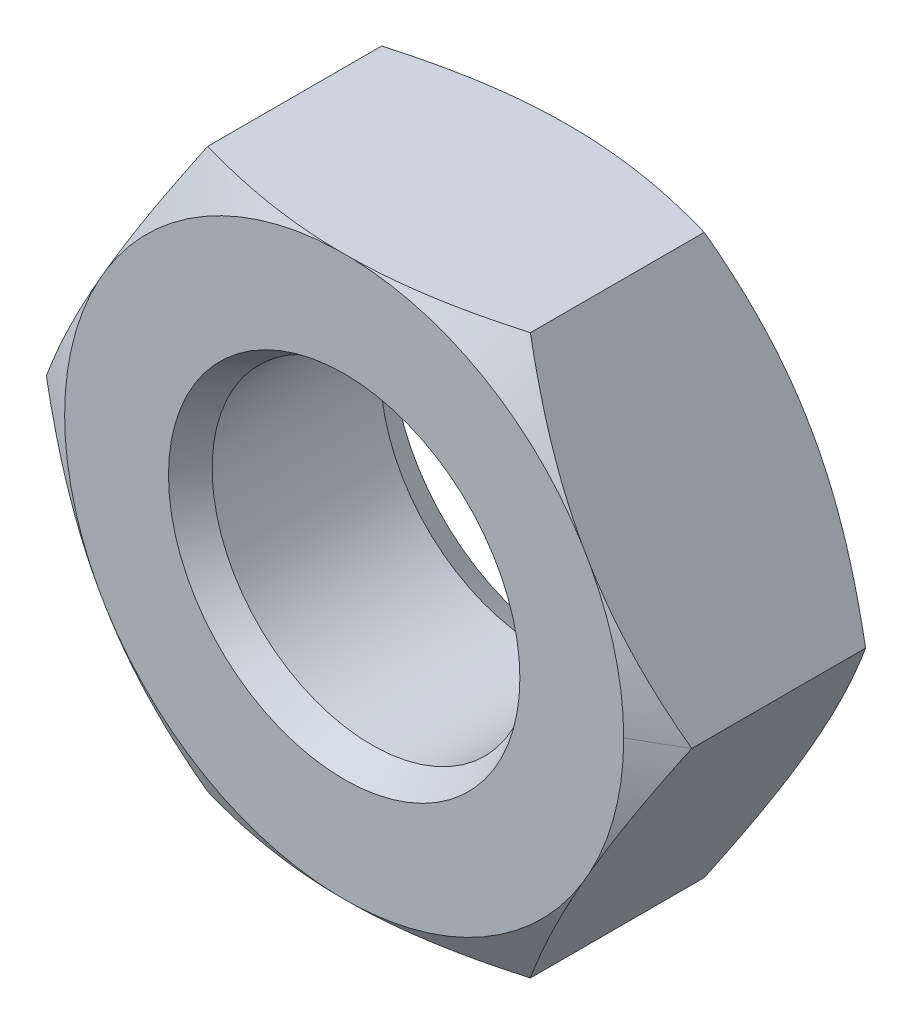
ISO-10303-21;
HEADER;
FILE_DESCRIPTION(('STEP AP214'),'2;1');
FILE_NAME('part.step','',(''),(''),'','','');
FILE_SCHEMA(('AUTOMOTIVE_DESIGN { 1 0 10303 214 1 1 1 1 }'));
ENDSEC;
DATA;
#1=APPLICATION_CONTEXT('core data for automotive mechanical design processes');
#2=APPLICATION_PROTOCOL_DEFINITION('international standard','automotive_design',2000,#1);
#3=PRODUCT_CONTEXT('',#1,'mechanical');
#4=PRODUCT('Part','Part','',(#3));
#5=PRODUCT_RELATED_PRODUCT_CATEGORY('part','',(#4));
#6=PRODUCT_DEFINITION_FORMATION('','',#4);
#7=PRODUCT_DEFINITION_CONTEXT('part definition',#1,'design');
#8=PRODUCT_DEFINITION('design','',#6,#7);
#9=PRODUCT_DEFINITION_SHAPE('','',#8);
#10=(LENGTH_UNIT() NAMED_UNIT(*) SI_UNIT(.MILLI.,.METRE.));
#11=(NAMED_UNIT(*) PLANE_ANGLE_UNIT() SI_UNIT($,.RADIAN.));
#12=(NAMED_UNIT(*) SI_UNIT($,.STERADIAN.) SOLID_ANGLE_UNIT());
#13=UNCERTAINTY_MEASURE_WITH_UNIT(LENGTH_MEASURE(1.E-05),#10,'distance_accuracy_value','');
#14=(GEOMETRIC_REPRESENTATION_CONTEXT(3) GLOBAL_UNCERTAINTY_ASSIGNED_CONTEXT((#13)) GLOBAL_UNIT_ASSIGNED_CONTEXT((#10,
#11,#12)) REPRESENTATION_CONTEXT('',''));
#15=CARTESIAN_POINT('',(0.,0.,0.));
#16=DIRECTION('',(0.,0.,1.));
#17=DIRECTION('',(1.,0.,0.));
#18=AXIS2_PLACEMENT_3D('',#15,#16,#17);
#19=CARTESIAN_POINT('',(0.,0.,2.8));
#20=DIRECTION('',(0.,0.,-1.));
#21=DIRECTION('',(1.,0.,0.));
#22=AXIS2_PLACEMENT_3D('',#19,#20,#21);
#23=CONICAL_SURFACE('',#22,3.5,1.047197551197);
#24=CARTESIAN_POINT('',(4.04000000000307,3.98991950589789E-12,2.48823085463512));
#25=CARTESIAN_POINT('',(3.52396456189784,-0.893799597299876,2.78616405373726));
#26=CARTESIAN_POINT('',(3.07690415759909,-1.6681309315972,2.79999999999928));
#27=(BOUNDED_CURVE() B_SPLINE_CURVE(2,(#24,#25,#26),.UNSPECIFIED.,.F.,
.F.) B_SPLINE_CURVE_WITH_KNOTS((3,3),(0.,1.),
.UNSPECIFIED.) CURVE() GEOMETRIC_REPRESENTATION_ITEM() RATIONAL_B_SPLINE_CURVE((1.,
1.0343199677934,1.)) REPRESENTATION_ITEM(''));
#28=CARTESIAN_POINT('',(4.04,0.,2.488230854638));
#29=VERTEX_POINT('',#28);
#30=CARTESIAN_POINT('',(3.076904157598,-1.668130931598,2.8));
#31=VERTEX_POINT('',#30);
#32=EDGE_CURVE('E348',#29,#31,#27,.T.);
#33=ORIENTED_EDGE('',*,*,#32,.F.);
#34=DIRECTION('',(0.866025403784329,0.,-0.50000000000019));
#35=VECTOR('',#34,1.);
#36=CARTESIAN_POINT('',(3.5,0.,2.8));
#37=LINE('',#36,#35);
#38=CARTESIAN_POINT('',(3.5,0.,2.8));
#39=VERTEX_POINT('',#38);
#40=EDGE_CURVE('E10',#39,#29,#37,.T.);
#41=ORIENTED_EDGE('',*,*,#40,.F.);
#42=CARTESIAN_POINT('',(0.,0.,2.8));
#43=DIRECTION('',(0.,0.,1.));
#44=DIRECTION('',(1.,0.,0.));
#45=AXIS2_PLACEMENT_3D('',#42,#43,#44);
#46=CIRCLE('',#45,3.5);
#47=EDGE_CURVE('E267',#31,#39,#46,.T.);
#48=ORIENTED_EDGE('',*,*,#47,.F.);
#49=EDGE_LOOP('',(#33,#41,#48));
#50=FACE_BOUND('',#49,.T.);
#51=ADVANCED_FACE('F15',(#50),#23,.T.);
#52=CARTESIAN_POINT('',(0.,0.,2.8));
#53=DIRECTION('',(0.,0.,-1.));
#54=DIRECTION('',(1.,0.,0.));
#55=AXIS2_PLACEMENT_3D('',#52,#53,#54);
#56=CONICAL_SURFACE('',#55,3.5,1.047197551197);
#57=CARTESIAN_POINT('',(2.02000000000384,-3.498742631289,2.48823085463578));
#58=CARTESIAN_POINT('',(0.987929123794527,-3.498742631289,2.78616405373733));
#59=CARTESIAN_POINT('',(0.0938083151977697,-3.498742631289,2.79999999999929));
#60=(BOUNDED_CURVE() B_SPLINE_CURVE(2,(#57,#58,#59),.UNSPECIFIED.,.F.,
.F.) B_SPLINE_CURVE_WITH_KNOTS((3,3),(0.,1.),
.UNSPECIFIED.) CURVE() GEOMETRIC_REPRESENTATION_ITEM() RATIONAL_B_SPLINE_CURVE((1.,
1.03431996779335,1.)) REPRESENTATION_ITEM(''));
#61=CARTESIAN_POINT('',(2.02,-3.498742631289,2.488230854638));
#62=VERTEX_POINT('',#61);
#63=CARTESIAN_POINT('',(0.09380831519654,-3.498742631289,2.8));
#64=VERTEX_POINT('',#63);
#65=EDGE_CURVE('E295',#62,#64,#60,.T.);
#66=ORIENTED_EDGE('',*,*,#65,.F.);
#67=CARTESIAN_POINT('',(2.98309584240254,-1.83061169968998,2.79999999999934));
#68=CARTESIAN_POINT('',(2.5360354381045,-2.60494303398606,2.78616405373781));
#69=CARTESIAN_POINT('',(2.02000000000055,-3.49874263128773,2.48823085463721));
#70=(BOUNDED_CURVE() B_SPLINE_CURVE(2,(#67,#68,#69),.UNSPECIFIED.,.F.,
.F.) B_SPLINE_CURVE_WITH_KNOTS((3,3),(0.,1.),
.UNSPECIFIED.) CURVE() GEOMETRIC_REPRESENTATION_ITEM() RATIONAL_B_SPLINE_CURVE((1.,
1.0343199677933,1.)) REPRESENTATION_ITEM(''));
#71=CARTESIAN_POINT('',(2.983095842402,-1.830611699691,2.8));
#72=VERTEX_POINT('',#71);
#73=EDGE_CURVE('E339',#72,#62,#70,.T.);
#74=ORIENTED_EDGE('',*,*,#73,.F.);
#75=CARTESIAN_POINT('',(0.,0.,2.8));
#76=DIRECTION('',(0.,0.,1.));
#77=DIRECTION('',(1.,0.,0.));
#78=AXIS2_PLACEMENT_3D('',#75,#76,#77);
#79=CIRCLE('',#78,3.5);
#80=EDGE_CURVE('E400',#64,#72,#79,.T.);
#81=ORIENTED_EDGE('',*,*,#80,.F.);
#82=EDGE_LOOP('',(#66,#74,#81));
#83=FACE_BOUND('',#82,.T.);
#84=ADVANCED_FACE('F596',(#83),#56,.T.);
#85=CARTESIAN_POINT('',(0.,0.,2.8));
#86=DIRECTION('',(0.,0.,-1.));
#87=DIRECTION('',(1.,0.,0.));
#88=AXIS2_PLACEMENT_3D('',#85,#86,#87);
#89=CONICAL_SURFACE('',#88,3.5,1.047197551197);
#90=CARTESIAN_POINT('',(0.,0.,2.8));
#91=DIRECTION('',(0.,0.,1.));
#92=DIRECTION('',(1.,0.,0.));
#93=AXIS2_PLACEMENT_3D('',#90,#91,#92);
#94=CIRCLE('',#93,3.5);
#95=CARTESIAN_POINT('',(-2.983095842402,-1.830611699691,2.8));
#96=VERTEX_POINT('',#95);
#97=CARTESIAN_POINT('',(-0.09380831519635,-3.498742631289,2.8));
#98=VERTEX_POINT('',#97);
#99=EDGE_CURVE('E401',#96,#98,#94,.T.);
#100=ORIENTED_EDGE('',*,*,#99,.F.);
#101=CARTESIAN_POINT('',(-2.0199999999978,-3.49874263129249,2.48823085463562));
#102=CARTESIAN_POINT('',(-2.53603543810275,-2.6049430339891,2.78616405373741));
#103=CARTESIAN_POINT('',(-2.98309584240135,-1.83061169969203,2.7999999999993));
#104=(BOUNDED_CURVE() B_SPLINE_CURVE(2,(#101,#102,#103),.UNSPECIFIED.,.F.,
.F.) B_SPLINE_CURVE_WITH_KNOTS((3,3),(0.,1.),
.UNSPECIFIED.) CURVE() GEOMETRIC_REPRESENTATION_ITEM() RATIONAL_B_SPLINE_CURVE((1.,
1.03431996779338,1.)) REPRESENTATION_ITEM(''));
#105=CARTESIAN_POINT('',(-2.02,-3.498742631289,2.488230854638));
#106=VERTEX_POINT('',#105);
#107=EDGE_CURVE('E278',#106,#96,#104,.T.);
#108=ORIENTED_EDGE('',*,*,#107,.F.);
#109=CARTESIAN_POINT('',(-0.0938083151951893,-3.498742631289,2.79999999999933));
#110=CARTESIAN_POINT('',(-0.987929123791061,-3.498742631289,2.78616405373777));
#111=CARTESIAN_POINT('',(-2.01999999999872,-3.498742631289,2.48823085463726));
#112=(BOUNDED_CURVE() B_SPLINE_CURVE(2,(#109,#110,#111),.UNSPECIFIED.,.F.,
.F.) B_SPLINE_CURVE_WITH_KNOTS((3,3),(0.,1.),
.UNSPECIFIED.) CURVE() GEOMETRIC_REPRESENTATION_ITEM() RATIONAL_B_SPLINE_CURVE((1.,
1.03431996779328,1.)) REPRESENTATION_ITEM(''));
#113=EDGE_CURVE('E389',#98,#106,#112,.T.);
#114=ORIENTED_EDGE('',*,*,#113,.F.);
#115=EDGE_LOOP('',(#100,#108,#114));
#116=FACE_BOUND('',#115,.T.);
#117=ADVANCED_FACE('F591',(#116),#89,.T.);
#118=CARTESIAN_POINT('',(0.,0.,2.8));
#119=DIRECTION('',(0.,0.,-1.));
#120=DIRECTION('',(1.,0.,0.));
#121=AXIS2_PLACEMENT_3D('',#118,#119,#120);
#122=CONICAL_SURFACE('',#121,3.5,1.047197551197);
#123=CARTESIAN_POINT('',(0.,0.,2.8));
#124=DIRECTION('',(0.,0.,1.));
#125=DIRECTION('',(1.,0.,0.));
#126=AXIS2_PLACEMENT_3D('',#123,#124,#125);
#127=CIRCLE('',#126,3.5);
#128=CARTESIAN_POINT('',(-3.076904157598,1.668130931598,2.8));
#129=VERTEX_POINT('',#128);
#130=CARTESIAN_POINT('',(-3.076904157598,-1.668130931598,2.8));
#131=VERTEX_POINT('',#130);
#132=EDGE_CURVE('E349',#129,#131,#127,.T.);
#133=ORIENTED_EDGE('',*,*,#132,.F.);
#134=CARTESIAN_POINT('',(-4.04000000000313,-4.10826928032293E-12,2.48823085463508));
#135=CARTESIAN_POINT('',(-3.52396456189787,0.893799597299828,2.78616405373726));
#136=CARTESIAN_POINT('',(-3.07690415759909,1.6681309315972,2.79999999999928));
#137=(BOUNDED_CURVE() B_SPLINE_CURVE(2,(#134,#135,#136),.UNSPECIFIED.,.F.,
.F.) B_SPLINE_CURVE_WITH_KNOTS((3,3),(0.,1.),
.UNSPECIFIED.) CURVE() GEOMETRIC_REPRESENTATION_ITEM() RATIONAL_B_SPLINE_CURVE((1.,
1.03431996779341,1.)) REPRESENTATION_ITEM(''));
#138=CARTESIAN_POINT('',(-4.04,0.,2.488230854638));
#139=VERTEX_POINT('',#138);
#140=EDGE_CURVE('E220',#139,#129,#137,.T.);
#141=ORIENTED_EDGE('',*,*,#140,.F.);
#142=CARTESIAN_POINT('',(-3.07690415759788,-1.66813093159929,2.79999999999932));
#143=CARTESIAN_POINT('',(-3.52396456189583,-0.893799597303355,2.78616405373768));
#144=CARTESIAN_POINT('',(-4.03999999999972,-1.80921944092916E-12,2.48823085463706));
#145=(BOUNDED_CURVE() B_SPLINE_CURVE(2,(#142,#143,#144),.UNSPECIFIED.,.F.,
.F.) B_SPLINE_CURVE_WITH_KNOTS((3,3),(0.,1.),
.UNSPECIFIED.) CURVE() GEOMETRIC_REPRESENTATION_ITEM() RATIONAL_B_SPLINE_CURVE((1.,
1.03431996779329,1.)) REPRESENTATION_ITEM(''));
#146=EDGE_CURVE('E286',#131,#139,#145,.T.);
#147=ORIENTED_EDGE('',*,*,#146,.F.);
#148=EDGE_LOOP('',(#133,#141,#147));
#149=FACE_BOUND('',#148,.T.);
#150=ADVANCED_FACE('F584',(#149),#122,.T.);
#151=CARTESIAN_POINT('',(0.,0.,2.8));
#152=DIRECTION('',(0.,0.,-1.));
#153=DIRECTION('',(1.,0.,0.));
#154=AXIS2_PLACEMENT_3D('',#151,#152,#153);
#155=CONICAL_SURFACE('',#154,3.5,1.047197551197);
#156=CARTESIAN_POINT('',(0.,0.,2.8));
#157=DIRECTION('',(0.,0.,1.));
#158=DIRECTION('',(1.,0.,0.));
#159=AXIS2_PLACEMENT_3D('',#156,#157,#158);
#160=CIRCLE('',#159,3.5);
#161=CARTESIAN_POINT('',(-0.09380831519634,3.498742631289,2.8));
#162=VERTEX_POINT('',#161);
#163=CARTESIAN_POINT('',(-2.983095842402,1.830611699691,2.8));
#164=VERTEX_POINT('',#163);
#165=EDGE_CURVE('E499',#162,#164,#160,.T.);
#166=ORIENTED_EDGE('',*,*,#165,.F.);
#167=CARTESIAN_POINT('',(-2.02000000000384,3.498742631289,2.48823085463578));
#168=CARTESIAN_POINT('',(-0.987929123794415,3.498742631289,2.78616405373737));
#169=CARTESIAN_POINT('',(-0.0938083151975641,3.498742631289,2.79999999999929));
#170=(BOUNDED_CURVE() B_SPLINE_CURVE(2,(#167,#168,#169),.UNSPECIFIED.,.F.,
.F.) B_SPLINE_CURVE_WITH_KNOTS((3,3),(0.,1.),
.UNSPECIFIED.) CURVE() GEOMETRIC_REPRESENTATION_ITEM() RATIONAL_B_SPLINE_CURVE((1.,
1.03431996779335,1.)) REPRESENTATION_ITEM(''));
#171=CARTESIAN_POINT('',(-2.02,3.498742631289,2.488230854638));
#172=VERTEX_POINT('',#171);
#173=EDGE_CURVE('E307',#172,#162,#170,.T.);
#174=ORIENTED_EDGE('',*,*,#173,.F.);
#175=CARTESIAN_POINT('',(-2.98309584240254,1.83061169968998,2.79999999999934));
#176=CARTESIAN_POINT('',(-2.5360354381045,2.60494303398606,2.78616405373781));
#177=CARTESIAN_POINT('',(-2.02000000000055,3.49874263128773,2.48823085463721));
#178=(BOUNDED_CURVE() B_SPLINE_CURVE(2,(#175,#176,#177),.UNSPECIFIED.,.F.,
.F.) B_SPLINE_CURVE_WITH_KNOTS((3,3),(0.,1.),
.UNSPECIFIED.) CURVE() GEOMETRIC_REPRESENTATION_ITEM() RATIONAL_B_SPLINE_CURVE((1.,
1.0343199677933,1.)) REPRESENTATION_ITEM(''));
#179=EDGE_CURVE('E308',#164,#172,#178,.T.);
#180=ORIENTED_EDGE('',*,*,#179,.F.);
#181=EDGE_LOOP('',(#166,#174,#180));
#182=FACE_BOUND('',#181,.T.);
#183=ADVANCED_FACE('F702',(#182),#155,.T.);
#184=CARTESIAN_POINT('',(0.,0.,2.8));
#185=DIRECTION('',(0.,0.,-1.));
#186=DIRECTION('',(1.,0.,0.));
#187=AXIS2_PLACEMENT_3D('',#184,#185,#186);
#188=CONICAL_SURFACE('',#187,3.5,1.047197551197);
#189=CARTESIAN_POINT('',(0.0938083151953652,3.498742631289,2.79999999999933));
#190=CARTESIAN_POINT('',(0.987929123791154,3.498742631289,2.78616405373774));
#191=CARTESIAN_POINT('',(2.01999999999872,3.498742631289,2.48823085463726));
#192=(BOUNDED_CURVE() B_SPLINE_CURVE(2,(#189,#190,#191),.UNSPECIFIED.,.F.,
.F.) B_SPLINE_CURVE_WITH_KNOTS((3,3),(0.,1.),
.UNSPECIFIED.) CURVE() GEOMETRIC_REPRESENTATION_ITEM() RATIONAL_B_SPLINE_CURVE((1.,
1.03431996779327,1.)) REPRESENTATION_ITEM(''));
#193=CARTESIAN_POINT('',(0.09380831519653,3.498742631289,2.8));
#194=VERTEX_POINT('',#193);
#195=CARTESIAN_POINT('',(2.02,3.498742631289,2.488230854638));
#196=VERTEX_POINT('',#195);
#197=EDGE_CURVE('E297',#194,#196,#192,.T.);
#198=ORIENTED_EDGE('',*,*,#197,.F.);
#199=CARTESIAN_POINT('',(0.,0.,2.8));
#200=DIRECTION('',(0.,0.,1.));
#201=DIRECTION('',(1.,0.,0.));
#202=AXIS2_PLACEMENT_3D('',#199,#200,#201);
#203=CIRCLE('',#202,3.5);
#204=CARTESIAN_POINT('',(2.983095842402,1.830611699691,2.8));
#205=VERTEX_POINT('',#204);
#206=EDGE_CURVE('E333',#205,#194,#203,.T.);
#207=ORIENTED_EDGE('',*,*,#206,.F.);
#208=CARTESIAN_POINT('',(2.0199999999978,3.49874263129249,2.48823085463562));
#209=CARTESIAN_POINT('',(2.53603543810275,2.6049430339891,2.78616405373741));
#210=CARTESIAN_POINT('',(2.98309584240135,1.83061169969203,2.7999999999993));
#211=(BOUNDED_CURVE() B_SPLINE_CURVE(2,(#208,#209,#210),.UNSPECIFIED.,.F.,
.F.) B_SPLINE_CURVE_WITH_KNOTS((3,3),(0.,1.),
.UNSPECIFIED.) CURVE() GEOMETRIC_REPRESENTATION_ITEM() RATIONAL_B_SPLINE_CURVE((1.,
1.03431996779338,1.)) REPRESENTATION_ITEM(''));
#212=EDGE_CURVE('E405',#196,#205,#211,.T.);
#213=ORIENTED_EDGE('',*,*,#212,.F.);
#214=EDGE_LOOP('',(#198,#207,#213));
#215=FACE_BOUND('',#214,.T.);
#216=ADVANCED_FACE('F628',(#215),#188,.T.);
#217=CARTESIAN_POINT('',(0.,0.,2.8));
#218=DIRECTION('',(0.,0.,-1.));
#219=DIRECTION('',(1.,0.,0.));
#220=AXIS2_PLACEMENT_3D('',#217,#218,#219);
#221=CONICAL_SURFACE('',#220,3.5,1.047197551197);
#222=CARTESIAN_POINT('',(3.07690415759788,1.66813093159929,2.79999999999932));
#223=CARTESIAN_POINT('',(3.52396456189584,0.893799597303337,2.78616405373767));
#224=CARTESIAN_POINT('',(4.03999999999974,1.76947345664757E-12,2.48823085463704));
#225=(BOUNDED_CURVE() B_SPLINE_CURVE(2,(#222,#223,#224),.UNSPECIFIED.,.F.,
.F.) B_SPLINE_CURVE_WITH_KNOTS((3,3),(0.,1.),
.UNSPECIFIED.) CURVE() GEOMETRIC_REPRESENTATION_ITEM() RATIONAL_B_SPLINE_CURVE((1.,
1.03431996779329,1.)) REPRESENTATION_ITEM(''));
#226=CARTESIAN_POINT('',(3.076904157598,1.668130931598,2.8));
#227=VERTEX_POINT('',#226);
#228=EDGE_CURVE('E412',#227,#29,#225,.T.);
#229=ORIENTED_EDGE('',*,*,#228,.F.);
#230=CARTESIAN_POINT('',(0.,0.,2.8));
#231=DIRECTION('',(0.,0.,1.));
#232=DIRECTION('',(1.,0.,0.));
#233=AXIS2_PLACEMENT_3D('',#230,#231,#232);
#234=CIRCLE('',#233,3.5);
#235=EDGE_CURVE('E262',#39,#227,#234,.T.);
#236=ORIENTED_EDGE('',*,*,#235,.F.);
#237=ORIENTED_EDGE('',*,*,#40,.T.);
#238=EDGE_LOOP('',(#229,#236,#237));
#239=FACE_BOUND('',#238,.T.);
#240=ADVANCED_FACE('F630',(#239),#221,.T.);
#241=CARTESIAN_POINT('',(0.,0.,0.311769145362));
#242=DIRECTION('',(0.,0.,1.));
#243=DIRECTION('',(1.,0.,0.));
#244=AXIS2_PLACEMENT_3D('',#241,#242,#243);
#245=CONICAL_SURFACE('',#244,4.04,1.047197551197);
#246=CARTESIAN_POINT('',(0.,0.,0.));
#247=DIRECTION('',(0.,0.,1.));
#248=DIRECTION('',(1.,0.,0.));
#249=AXIS2_PLACEMENT_3D('',#246,#247,#248);
#250=CIRCLE('',#249,3.5);
#251=CARTESIAN_POINT('',(3.5,0.,0.));
#252=VERTEX_POINT('',#251);
#253=CARTESIAN_POINT('',(3.076904157598,1.668130931598,0.));
#254=VERTEX_POINT('',#253);
#255=EDGE_CURVE('E249',#252,#254,#250,.T.);
#256=ORIENTED_EDGE('',*,*,#255,.T.);
#257=CARTESIAN_POINT('',(4.04000000000307,-3.98991950589789E-12,0.31176914536488));
#258=CARTESIAN_POINT('',(3.52396456189784,0.893799597299875,0.0138359462627423));
#259=CARTESIAN_POINT('',(3.07690415759909,1.6681309315972,7.16759984698001E-13));
#260=(BOUNDED_CURVE() B_SPLINE_CURVE(2,(#257,#258,#259),.UNSPECIFIED.,.F.,
.F.) B_SPLINE_CURVE_WITH_KNOTS((3,3),(0.,1.),
.UNSPECIFIED.) CURVE() GEOMETRIC_REPRESENTATION_ITEM() RATIONAL_B_SPLINE_CURVE((1.,
1.0343199677934,1.)) REPRESENTATION_ITEM(''));
#261=CARTESIAN_POINT('',(4.04,0.,0.311769145362));
#262=VERTEX_POINT('',#261);
#263=EDGE_CURVE('E26',#262,#254,#260,.T.);
#264=ORIENTED_EDGE('',*,*,#263,.F.);
#265=DIRECTION('',(-0.866025403784329,0.,-0.50000000000019));
#266=VECTOR('',#265,1.);
#267=CARTESIAN_POINT('',(4.04,0.,0.311769145362));
#268=LINE('',#267,#266);
#269=EDGE_CURVE('E266',#262,#252,#268,.T.);
#270=ORIENTED_EDGE('',*,*,#269,.T.);
#271=EDGE_LOOP('',(#256,#264,#270));
#272=FACE_BOUND('',#271,.T.);
#273=ADVANCED_FACE('F618',(#272),#245,.T.);
#274=CARTESIAN_POINT('',(4.04,0.,0.));
#275=DIRECTION('',(-0.866025403784329,-0.50000000000019,0.));
#276=DIRECTION('',(-0.50000000000019,0.866025403784329,0.));
#277=AXIS2_PLACEMENT_3D('',#274,#275,#276);
#278=PLANE('',#277);
#279=DIRECTION('',(-0.50000000000019,0.866025403784329,0.));
#280=VECTOR('',#279,1.);
#281=CARTESIAN_POINT('',(4.04,0.,0.));
#282=LINE('',#281,#280);
#283=CARTESIAN_POINT('',(2.983095842402,1.830611699691,0.));
#284=VERTEX_POINT('',#283);
#285=EDGE_CURVE('E253',#254,#284,#282,.T.);
#286=ORIENTED_EDGE('',*,*,#285,.T.);
#287=CARTESIAN_POINT('',(2.98309584240254,1.83061169968998,6.66577903984944E-13));
#288=CARTESIAN_POINT('',(2.53603543810451,2.60494303398607,0.0138359462621894));
#289=CARTESIAN_POINT('',(2.02000000000055,3.49874263128773,0.311769145362794));
#290=(BOUNDED_CURVE() B_SPLINE_CURVE(2,(#287,#288,#289),.UNSPECIFIED.,.F.,
.F.) B_SPLINE_CURVE_WITH_KNOTS((3,3),(0.,1.),
.UNSPECIFIED.) CURVE() GEOMETRIC_REPRESENTATION_ITEM() RATIONAL_B_SPLINE_CURVE((1.,
1.0343199677933,1.)) REPRESENTATION_ITEM(''));
#291=CARTESIAN_POINT('',(2.02,3.498742631289,0.311769145362));
#292=VERTEX_POINT('',#291);
#293=EDGE_CURVE('E40',#284,#292,#290,.T.);
#294=ORIENTED_EDGE('',*,*,#293,.T.);
#295=DIRECTION('',(0.,0.,1.));
#296=VECTOR('',#295,1.);
#297=CARTESIAN_POINT('',(2.02,3.498742631289,0.));
#298=LINE('',#297,#296);
#299=EDGE_CURVE('E306',#292,#196,#298,.T.);
#300=ORIENTED_EDGE('',*,*,#299,.T.);
#301=ORIENTED_EDGE('',*,*,#212,.T.);
#302=DIRECTION('',(-0.50000000000019,0.866025403784329,0.));
#303=VECTOR('',#302,1.);
#304=CARTESIAN_POINT('',(4.04,0.,2.8));
#305=LINE('',#304,#303);
#306=EDGE_CURVE('E329',#227,#205,#305,.T.);
#307=ORIENTED_EDGE('',*,*,#306,.F.);
#308=ORIENTED_EDGE('',*,*,#228,.T.);
#309=DIRECTION('',(0.,0.,-1.));
#310=VECTOR('',#309,1.);
#311=CARTESIAN_POINT('',(4.04,0.,2.488230854638));
#312=LINE('',#311,#310);
#313=EDGE_CURVE('E367',#29,#262,#312,.T.);
#314=ORIENTED_EDGE('',*,*,#313,.T.);
#315=ORIENTED_EDGE('',*,*,#263,.T.);
#316=EDGE_LOOP('',(#286,#294,#300,#301,#307,#308,#314,#315));
#317=FACE_BOUND('',#316,.T.);
#318=ADVANCED_FACE('F615',(#317),#278,.F.);
#319=CARTESIAN_POINT('',(0.,0.,0.311769145362));
#320=DIRECTION('',(0.,0.,1.));
#321=DIRECTION('',(1.,0.,0.));
#322=AXIS2_PLACEMENT_3D('',#319,#320,#321);
#323=CONICAL_SURFACE('',#322,4.04,1.047197551197);
#324=CARTESIAN_POINT('',(0.,0.,0.));
#325=DIRECTION('',(0.,0.,1.));
#326=DIRECTION('',(1.,0.,0.));
#327=AXIS2_PLACEMENT_3D('',#324,#325,#326);
#328=CIRCLE('',#327,3.5);
#329=CARTESIAN_POINT('',(0.09380831519634,3.498742631289,0.));
#330=VERTEX_POINT('',#329);
#331=EDGE_CURVE('E324',#284,#330,#328,.T.);
#332=ORIENTED_EDGE('',*,*,#331,.T.);
#333=CARTESIAN_POINT('',(2.02000000000384,3.498742631289,0.31176914536422));
#334=CARTESIAN_POINT('',(0.987929123794415,3.498742631289,0.0138359462626313));
#335=CARTESIAN_POINT('',(0.0938083151975649,3.498742631289,7.069900220813E-13));
#336=(BOUNDED_CURVE() B_SPLINE_CURVE(2,(#333,#334,#335),.UNSPECIFIED.,.F.,
.F.) B_SPLINE_CURVE_WITH_KNOTS((3,3),(0.,1.),
.UNSPECIFIED.) CURVE() GEOMETRIC_REPRESENTATION_ITEM() RATIONAL_B_SPLINE_CURVE((1.,
1.03431996779336,1.)) REPRESENTATION_ITEM(''));
#337=EDGE_CURVE('E406',#292,#330,#336,.T.);
#338=ORIENTED_EDGE('',*,*,#337,.F.);
#339=ORIENTED_EDGE('',*,*,#293,.F.);
#340=EDGE_LOOP('',(#332,#338,#339));
#341=FACE_BOUND('',#340,.T.);
#342=ADVANCED_FACE('F622',(#341),#323,.T.);
#343=CARTESIAN_POINT('',(2.02,3.498742631289,0.));
#344=DIRECTION('',(0.,-1.,0.));
#345=DIRECTION('',(-1.,0.,0.));
#346=AXIS2_PLACEMENT_3D('',#343,#344,#345);
#347=PLANE('',#346);
#348=DIRECTION('',(-1.,0.,0.));
#349=VECTOR('',#348,1.);
#350=CARTESIAN_POINT('',(2.02,3.498742631289,0.));
#351=LINE('',#350,#349);
#352=CARTESIAN_POINT('',(-0.09380831519615,3.498742631289,0.));
#353=VERTEX_POINT('',#352);
#354=EDGE_CURVE('E261',#330,#353,#351,.T.);
#355=ORIENTED_EDGE('',*,*,#354,.T.);
#356=CARTESIAN_POINT('',(-0.0938083151949937,3.498742631289,6.67466082404644E-13));
#357=CARTESIAN_POINT('',(-0.987929123790953,3.49874263128901,0.0138359462621993));
#358=CARTESIAN_POINT('',(-2.01999999999872,3.498742631289,0.31176914536274));
#359=(BOUNDED_CURVE() B_SPLINE_CURVE(2,(#356,#357,#358),.UNSPECIFIED.,.F.,
.F.) B_SPLINE_CURVE_WITH_KNOTS((3,3),(0.,1.),
.UNSPECIFIED.) CURVE() GEOMETRIC_REPRESENTATION_ITEM() RATIONAL_B_SPLINE_CURVE((1.,
1.03431996779329,1.)) REPRESENTATION_ITEM(''));
#360=CARTESIAN_POINT('',(-2.02,3.498742631289,0.311769145362));
#361=VERTEX_POINT('',#360);
#362=EDGE_CURVE('E452',#353,#361,#359,.T.);
#363=ORIENTED_EDGE('',*,*,#362,.T.);
#364=DIRECTION('',(0.,0.,1.));
#365=VECTOR('',#364,1.);
#366=CARTESIAN_POINT('',(-2.02,3.498742631289,0.));
#367=LINE('',#366,#365);
#368=EDGE_CURVE('E317',#361,#172,#367,.T.);
#369=ORIENTED_EDGE('',*,*,#368,.T.);
#370=ORIENTED_EDGE('',*,*,#173,.T.);
#371=DIRECTION('',(-1.,0.,0.));
#372=VECTOR('',#371,1.);
#373=CARTESIAN_POINT('',(2.02,3.498742631289,2.8));
#374=LINE('',#373,#372);
#375=EDGE_CURVE('E472',#194,#162,#374,.T.);
#376=ORIENTED_EDGE('',*,*,#375,.F.);
#377=ORIENTED_EDGE('',*,*,#197,.T.);
#378=ORIENTED_EDGE('',*,*,#299,.F.);
#379=ORIENTED_EDGE('',*,*,#337,.T.);
#380=EDGE_LOOP('',(#355,#363,#369,#370,#376,#377,#378,#379));
#381=FACE_BOUND('',#380,.T.);
#382=ADVANCED_FACE('F623',(#381),#347,.F.);
#383=CARTESIAN_POINT('',(0.,0.,0.311769145362));
#384=DIRECTION('',(0.,0.,1.));
#385=DIRECTION('',(1.,0.,0.));
#386=AXIS2_PLACEMENT_3D('',#383,#384,#385);
#387=CONICAL_SURFACE('',#386,4.04,1.047197551197);
#388=CARTESIAN_POINT('',(0.,0.,0.));
#389=DIRECTION('',(0.,0.,1.));
#390=DIRECTION('',(1.,0.,0.));
#391=AXIS2_PLACEMENT_3D('',#388,#389,#390);
#392=CIRCLE('',#391,3.5);
#393=CARTESIAN_POINT('',(-2.983095842402,1.830611699691,0.));
#394=VERTEX_POINT('',#393);
#395=EDGE_CURVE('E231',#353,#394,#392,.T.);
#396=ORIENTED_EDGE('',*,*,#395,.T.);
#397=CARTESIAN_POINT('',(-2.0199999999978,3.49874263129249,0.31176914536438));
#398=CARTESIAN_POINT('',(-2.53603543810276,2.6049430339891,0.0138359462625923));
#399=CARTESIAN_POINT('',(-2.98309584240135,1.83061169969203,7.02549129982799E-13));
#400=(BOUNDED_CURVE() B_SPLINE_CURVE(2,(#397,#398,#399),.UNSPECIFIED.,.F.,
.F.) B_SPLINE_CURVE_WITH_KNOTS((3,3),(0.,1.),
.UNSPECIFIED.) CURVE() GEOMETRIC_REPRESENTATION_ITEM() RATIONAL_B_SPLINE_CURVE((1.,
1.03431996779338,1.)) REPRESENTATION_ITEM(''));
#401=EDGE_CURVE('E226',#361,#394,#400,.T.);
#402=ORIENTED_EDGE('',*,*,#401,.F.);
#403=ORIENTED_EDGE('',*,*,#362,.F.);
#404=EDGE_LOOP('',(#396,#402,#403));
#405=FACE_BOUND('',#404,.T.);
#406=ADVANCED_FACE('F682',(#405),#387,.T.);
#407=CARTESIAN_POINT('',(-2.02,3.498742631289,0.));
#408=DIRECTION('',(0.866025403784329,-0.50000000000019,0.));
#409=DIRECTION('',(0.,0.,-1.));
#410=AXIS2_PLACEMENT_3D('',#407,#408,#409);
#411=PLANE('',#410);
#412=DIRECTION('',(-0.50000000000019,-0.866025403784329,0.));
#413=VECTOR('',#412,1.);
#414=CARTESIAN_POINT('',(-2.02,3.498742631289,0.));
#415=LINE('',#414,#413);
#416=CARTESIAN_POINT('',(-3.076904157598,1.668130931598,0.));
#417=VERTEX_POINT('',#416);
#418=EDGE_CURVE('E223',#394,#417,#415,.T.);
#419=ORIENTED_EDGE('',*,*,#418,.T.);
#420=CARTESIAN_POINT('',(-3.07690415759788,1.66813093159929,6.79456491070596E-13));
#421=CARTESIAN_POINT('',(-3.52396456189585,0.893799597303322,0.0138359462623244));
#422=CARTESIAN_POINT('',(-4.03999999999977,1.73017156157585E-12,0.311769145362973));
#423=(BOUNDED_CURVE() B_SPLINE_CURVE(2,(#420,#421,#422),.UNSPECIFIED.,.F.,
.F.) B_SPLINE_CURVE_WITH_KNOTS((3,3),(0.,1.),
.UNSPECIFIED.) CURVE() GEOMETRIC_REPRESENTATION_ITEM() RATIONAL_B_SPLINE_CURVE((1.,
1.03431996779328,1.)) REPRESENTATION_ITEM(''));
#424=CARTESIAN_POINT('',(-4.04,0.,0.311769145362));
#425=VERTEX_POINT('',#424);
#426=EDGE_CURVE('E209',#417,#425,#423,.T.);
#427=ORIENTED_EDGE('',*,*,#426,.T.);
#428=DIRECTION('',(0.,0.,1.));
#429=VECTOR('',#428,1.);
#430=CARTESIAN_POINT('',(-4.04,0.,0.));
#431=LINE('',#430,#429);
#432=EDGE_CURVE('E338',#425,#139,#431,.T.);
#433=ORIENTED_EDGE('',*,*,#432,.T.);
#434=ORIENTED_EDGE('',*,*,#140,.T.);
#435=DIRECTION('',(-0.50000000000019,-0.866025403784329,0.));
#436=VECTOR('',#435,1.);
#437=CARTESIAN_POINT('',(-2.02,3.498742631289,2.8));
#438=LINE('',#437,#436);
#439=EDGE_CURVE('E356',#164,#129,#438,.T.);
#440=ORIENTED_EDGE('',*,*,#439,.F.);
#441=ORIENTED_EDGE('',*,*,#179,.T.);
#442=ORIENTED_EDGE('',*,*,#368,.F.);
#443=ORIENTED_EDGE('',*,*,#401,.T.);
#444=EDGE_LOOP('',(#419,#427,#433,#434,#440,#441,#442,#443));
#445=FACE_BOUND('',#444,.T.);
#446=ADVANCED_FACE('F17',(#445),#411,.F.);
#447=CARTESIAN_POINT('',(0.,0.,0.311769145362));
#448=DIRECTION('',(0.,0.,1.));
#449=DIRECTION('',(1.,0.,0.));
#450=AXIS2_PLACEMENT_3D('',#447,#448,#449);
#451=CONICAL_SURFACE('',#450,4.04,1.047197551197);
#452=CARTESIAN_POINT('',(0.,0.,0.));
#453=DIRECTION('',(0.,0.,1.));
#454=DIRECTION('',(1.,0.,0.));
#455=AXIS2_PLACEMENT_3D('',#452,#453,#454);
#456=CIRCLE('',#455,3.5);
#457=CARTESIAN_POINT('',(-3.076904157598,-1.668130931598,0.));
#458=VERTEX_POINT('',#457);
#459=EDGE_CURVE('E213',#417,#458,#456,.T.);
#460=ORIENTED_EDGE('',*,*,#459,.T.);
#461=CARTESIAN_POINT('',(-4.04000000000299,3.871125642263E-12,0.31176914536484));
#462=CARTESIAN_POINT('',(-3.52396456189781,-0.893799597299924,0.0138359462627414));
#463=CARTESIAN_POINT('',(-3.07690415759909,-1.6681309315972,7.16759984698001E-13));
#464=(BOUNDED_CURVE() B_SPLINE_CURVE(2,(#461,#462,#463),.UNSPECIFIED.,.F.,
.F.) B_SPLINE_CURVE_WITH_KNOTS((3,3),(0.,1.),
.UNSPECIFIED.) CURVE() GEOMETRIC_REPRESENTATION_ITEM() RATIONAL_B_SPLINE_CURVE((1.,
1.03431996779341,1.)) REPRESENTATION_ITEM(''));
#465=EDGE_CURVE('E215',#425,#458,#464,.T.);
#466=ORIENTED_EDGE('',*,*,#465,.F.);
#467=ORIENTED_EDGE('',*,*,#426,.F.);
#468=EDGE_LOOP('',(#460,#466,#467));
#469=FACE_BOUND('',#468,.T.);
#470=ADVANCED_FACE('F211',(#469),#451,.T.);
#471=CARTESIAN_POINT('',(-4.04,0.,0.));
#472=DIRECTION('',(0.866025403784329,0.50000000000019,0.));
#473=DIRECTION('',(0.,0.,-1.));
#474=AXIS2_PLACEMENT_3D('',#471,#472,#473);
#475=PLANE('',#474);
#476=DIRECTION('',(0.50000000000019,-0.866025403784329,0.));
#477=VECTOR('',#476,1.);
#478=CARTESIAN_POINT('',(-4.04,0.,0.));
#479=LINE('',#478,#477);
#480=CARTESIAN_POINT('',(-2.983095842402,-1.830611699691,0.));
#481=VERTEX_POINT('',#480);
#482=EDGE_CURVE('E236',#458,#481,#479,.T.);
#483=ORIENTED_EDGE('',*,*,#482,.T.);
#484=CARTESIAN_POINT('',(-2.98309584240254,-1.83061169968998,6.66577903984944E-13));
#485=CARTESIAN_POINT('',(-2.53603543810451,-2.60494303398607,0.0138359462621894));
#486=CARTESIAN_POINT('',(-2.02000000000055,-3.49874263128773,0.311769145362794));
#487=(BOUNDED_CURVE() B_SPLINE_CURVE(2,(#484,#485,#486),.UNSPECIFIED.,.F.,
.F.) B_SPLINE_CURVE_WITH_KNOTS((3,3),(0.,1.),
.UNSPECIFIED.) CURVE() GEOMETRIC_REPRESENTATION_ITEM() RATIONAL_B_SPLINE_CURVE((1.,
1.0343199677933,1.)) REPRESENTATION_ITEM(''));
#488=CARTESIAN_POINT('',(-2.02,-3.498742631289,0.311769145362));
#489=VERTEX_POINT('',#488);
#490=EDGE_CURVE('E183',#481,#489,#487,.T.);
#491=ORIENTED_EDGE('',*,*,#490,.T.);
#492=DIRECTION('',(0.,0.,1.));
#493=VECTOR('',#492,1.);
#494=CARTESIAN_POINT('',(-2.02,-3.498742631289,0.));
#495=LINE('',#494,#493);
#496=EDGE_CURVE('E271',#489,#106,#495,.T.);
#497=ORIENTED_EDGE('',*,*,#496,.T.);
#498=ORIENTED_EDGE('',*,*,#107,.T.);
#499=DIRECTION('',(0.50000000000019,-0.866025403784329,0.));
#500=VECTOR('',#499,1.);
#501=CARTESIAN_POINT('',(-4.04,0.,2.8));
#502=LINE('',#501,#500);
#503=EDGE_CURVE('E355',#131,#96,#502,.T.);
#504=ORIENTED_EDGE('',*,*,#503,.F.);
#505=ORIENTED_EDGE('',*,*,#146,.T.);
#506=ORIENTED_EDGE('',*,*,#432,.F.);
#507=ORIENTED_EDGE('',*,*,#465,.T.);
#508=EDGE_LOOP('',(#483,#491,#497,#498,#504,#505,#506,#507));
#509=FACE_BOUND('',#508,.T.);
#510=ADVANCED_FACE('F587',(#509),#475,.F.);
#511=CARTESIAN_POINT('',(0.,0.,0.311769145362));
#512=DIRECTION('',(0.,0.,1.));
#513=DIRECTION('',(1.,0.,0.));
#514=AXIS2_PLACEMENT_3D('',#511,#512,#513);
#515=CONICAL_SURFACE('',#514,4.04,1.047197551197);
#516=CARTESIAN_POINT('',(0.,0.,0.));
#517=DIRECTION('',(0.,0.,1.));
#518=DIRECTION('',(1.,0.,0.));
#519=AXIS2_PLACEMENT_3D('',#516,#517,#518);
#520=CIRCLE('',#519,3.5);
#521=CARTESIAN_POINT('',(-0.09380831519616,-3.498742631289,0.));
#522=VERTEX_POINT('',#521);
#523=EDGE_CURVE('E243',#481,#522,#520,.T.);
#524=ORIENTED_EDGE('',*,*,#523,.T.);
#525=CARTESIAN_POINT('',(-2.02000000000384,-3.498742631289,0.311769145364219));
#526=CARTESIAN_POINT('',(-0.987929123794315,-3.498742631289,0.0138359462626022));
#527=CARTESIAN_POINT('',(-0.09380831519738,-3.498742631289,7.03881397612349E-13));
#528=(BOUNDED_CURVE() B_SPLINE_CURVE(2,(#525,#526,#527),.UNSPECIFIED.,.F.,
.F.) B_SPLINE_CURVE_WITH_KNOTS((3,3),(0.,1.),
.UNSPECIFIED.) CURVE() GEOMETRIC_REPRESENTATION_ITEM() RATIONAL_B_SPLINE_CURVE((1.,
1.03431996779337,1.)) REPRESENTATION_ITEM(''));
#529=EDGE_CURVE('E193',#489,#522,#528,.T.);
#530=ORIENTED_EDGE('',*,*,#529,.F.);
#531=ORIENTED_EDGE('',*,*,#490,.F.);
#532=EDGE_LOOP('',(#524,#530,#531));
#533=FACE_BOUND('',#532,.T.);
#534=ADVANCED_FACE('F673',(#533),#515,.T.);
#535=CARTESIAN_POINT('',(-2.02,-3.498742631289,0.));
#536=DIRECTION('',(0.,1.,0.));
#537=DIRECTION('',(1.,0.,0.));
#538=AXIS2_PLACEMENT_3D('',#535,#536,#537);
#539=PLANE('',#538);
#540=DIRECTION('',(1.,0.,0.));
#541=VECTOR('',#540,1.);
#542=CARTESIAN_POINT('',(-2.02,-3.498742631289,0.));
#543=LINE('',#542,#541);
#544=CARTESIAN_POINT('',(0.09380831519634,-3.498742631289,0.));
#545=VERTEX_POINT('',#544);
#546=EDGE_CURVE('E19',#522,#545,#543,.T.);
#547=ORIENTED_EDGE('',*,*,#546,.T.);
#548=CARTESIAN_POINT('',(0.0938083151951786,-3.498742631289,6.70130617663745E-13));
#549=CARTESIAN_POINT('',(0.987929123791054,-3.498742631289,0.0138359462622281));
#550=CARTESIAN_POINT('',(2.01999999999872,-3.498742631289,0.31176914536274));
#551=(BOUNDED_CURVE() B_SPLINE_CURVE(2,(#548,#549,#550),.UNSPECIFIED.,.F.,
.F.) B_SPLINE_CURVE_WITH_KNOTS((3,3),(0.,1.),
.UNSPECIFIED.) CURVE() GEOMETRIC_REPRESENTATION_ITEM() RATIONAL_B_SPLINE_CURVE((1.,
1.03431996779327,1.)) REPRESENTATION_ITEM(''));
#552=CARTESIAN_POINT('',(2.02,-3.498742631289,0.311769145362));
#553=VERTEX_POINT('',#552);
#554=EDGE_CURVE('E287',#545,#553,#551,.T.);
#555=ORIENTED_EDGE('',*,*,#554,.T.);
#556=DIRECTION('',(0.,0.,1.));
#557=VECTOR('',#556,1.);
#558=CARTESIAN_POINT('',(2.02,-3.498742631289,0.));
#559=LINE('',#558,#557);
#560=EDGE_CURVE('E247',#553,#62,#559,.T.);
#561=ORIENTED_EDGE('',*,*,#560,.T.);
#562=ORIENTED_EDGE('',*,*,#65,.T.);
#563=DIRECTION('',(1.,0.,0.));
#564=VECTOR('',#563,1.);
#565=CARTESIAN_POINT('',(-2.02,-3.498742631289,2.8));
#566=LINE('',#565,#564);
#567=EDGE_CURVE('E397',#98,#64,#566,.T.);
#568=ORIENTED_EDGE('',*,*,#567,.F.);
#569=ORIENTED_EDGE('',*,*,#113,.T.);
#570=ORIENTED_EDGE('',*,*,#496,.F.);
#571=ORIENTED_EDGE('',*,*,#529,.T.);
#572=EDGE_LOOP('',(#547,#555,#561,#562,#568,#569,#570,#571));
#573=FACE_BOUND('',#572,.T.);
#574=ADVANCED_FACE('F592',(#573),#539,.F.);
#575=CARTESIAN_POINT('',(0.,0.,0.311769145362));
#576=DIRECTION('',(0.,0.,1.));
#577=DIRECTION('',(1.,0.,0.));
#578=AXIS2_PLACEMENT_3D('',#575,#576,#577);
#579=CONICAL_SURFACE('',#578,4.04,1.047197551197);
#580=CARTESIAN_POINT('',(0.,0.,0.));
#581=DIRECTION('',(0.,0.,1.));
#582=DIRECTION('',(1.,0.,0.));
#583=AXIS2_PLACEMENT_3D('',#580,#581,#582);
#584=CIRCLE('',#583,3.5);
#585=CARTESIAN_POINT('',(2.983095842402,-1.830611699691,0.));
#586=VERTEX_POINT('',#585);
#587=EDGE_CURVE('E523',#545,#586,#584,.T.);
#588=ORIENTED_EDGE('',*,*,#587,.T.);
#589=CARTESIAN_POINT('',(2.0199999999978,-3.49874263129249,0.31176914536438));
#590=CARTESIAN_POINT('',(2.53603543810276,-2.6049430339891,0.0138359462625923));
#591=CARTESIAN_POINT('',(2.98309584240135,-1.83061169969203,7.02549129982799E-13));
#592=(BOUNDED_CURVE() B_SPLINE_CURVE(2,(#589,#590,#591),.UNSPECIFIED.,.F.,
.F.) B_SPLINE_CURVE_WITH_KNOTS((3,3),(0.,1.),
.UNSPECIFIED.) CURVE() GEOMETRIC_REPRESENTATION_ITEM() RATIONAL_B_SPLINE_CURVE((1.,
1.03431996779338,1.)) REPRESENTATION_ITEM(''));
#593=EDGE_CURVE('E296',#553,#586,#592,.T.);
#594=ORIENTED_EDGE('',*,*,#593,.F.);
#595=ORIENTED_EDGE('',*,*,#554,.F.);
#596=EDGE_LOOP('',(#588,#594,#595));
#597=FACE_BOUND('',#596,.T.);
#598=ADVANCED_FACE('F603',(#597),#579,.T.);
#599=CARTESIAN_POINT('',(2.02,-3.498742631289,0.));
#600=DIRECTION('',(-0.866025403784329,0.50000000000019,0.));
#601=DIRECTION('',(0.,0.,1.));
#602=AXIS2_PLACEMENT_3D('',#599,#600,#601);
#603=PLANE('',#602);
#604=DIRECTION('',(0.50000000000019,0.866025403784329,0.));
#605=VECTOR('',#604,1.);
#606=CARTESIAN_POINT('',(2.02,-3.498742631289,0.));
#607=LINE('',#606,#605);
#608=CARTESIAN_POINT('',(3.076904157598,-1.668130931598,0.));
#609=VERTEX_POINT('',#608);
#610=EDGE_CURVE('E522',#586,#609,#607,.T.);
#611=ORIENTED_EDGE('',*,*,#610,.T.);
#612=CARTESIAN_POINT('',(3.07690415759788,-1.66813093159929,6.79456491070596E-13));
#613=CARTESIAN_POINT('',(3.52396456189584,-0.893799597303337,0.0138359462623241));
#614=CARTESIAN_POINT('',(4.03999999999974,-1.76947345664757E-12,0.31176914536296));
#615=(BOUNDED_CURVE() B_SPLINE_CURVE(2,(#612,#613,#614),.UNSPECIFIED.,.F.,
.F.) B_SPLINE_CURVE_WITH_KNOTS((3,3),(0.,1.),
.UNSPECIFIED.) CURVE() GEOMETRIC_REPRESENTATION_ITEM() RATIONAL_B_SPLINE_CURVE((1.,
1.03431996779329,1.)) REPRESENTATION_ITEM(''));
#616=EDGE_CURVE('E359',#609,#262,#615,.T.);
#617=ORIENTED_EDGE('',*,*,#616,.T.);
#618=ORIENTED_EDGE('',*,*,#313,.F.);
#619=ORIENTED_EDGE('',*,*,#32,.T.);
#620=DIRECTION('',(0.50000000000019,0.866025403784329,0.));
#621=VECTOR('',#620,1.);
#622=CARTESIAN_POINT('',(2.02,-3.498742631289,2.8));
#623=LINE('',#622,#621);
#624=EDGE_CURVE('E516',#72,#31,#623,.T.);
#625=ORIENTED_EDGE('',*,*,#624,.F.);
#626=ORIENTED_EDGE('',*,*,#73,.T.);
#627=ORIENTED_EDGE('',*,*,#560,.F.);
#628=ORIENTED_EDGE('',*,*,#593,.T.);
#629=EDGE_LOOP('',(#611,#617,#618,#619,#625,#626,#627,#628));
#630=FACE_BOUND('',#629,.T.);
#631=ADVANCED_FACE('F535',(#630),#603,.F.);
#632=CARTESIAN_POINT('',(0.,0.,0.311769145362));
#633=DIRECTION('',(0.,0.,1.));
#634=DIRECTION('',(1.,0.,0.));
#635=AXIS2_PLACEMENT_3D('',#632,#633,#634);
#636=CONICAL_SURFACE('',#635,4.04,1.047197551197);
#637=CARTESIAN_POINT('',(0.,0.,0.));
#638=DIRECTION('',(0.,0.,1.));
#639=DIRECTION('',(1.,0.,0.));
#640=AXIS2_PLACEMENT_3D('',#637,#638,#639);
#641=CIRCLE('',#640,3.5);
#642=EDGE_CURVE('E252',#609,#252,#641,.T.);
#643=ORIENTED_EDGE('',*,*,#642,.T.);
#644=ORIENTED_EDGE('',*,*,#269,.F.);
#645=ORIENTED_EDGE('',*,*,#616,.F.);
#646=EDGE_LOOP('',(#643,#644,#645));
#647=FACE_BOUND('',#646,.T.);
#648=ADVANCED_FACE('F609',(#647),#636,.T.);
#649=CARTESIAN_POINT('',(0.,0.,2.8));
#650=DIRECTION('',(0.,0.,1.));
#651=DIRECTION('',(1.,0.,0.));
#652=AXIS2_PLACEMENT_3D('',#649,#650,#651);
#653=PLANE('',#652);
#654=CARTESIAN_POINT('',(0.,0.,2.8));
#655=DIRECTION('',(0.,0.,1.));
#656=DIRECTION('',(1.,0.,0.));
#657=AXIS2_PLACEMENT_3D('',#654,#655,#656);
#658=CIRCLE('',#657,2.2);
#659=CARTESIAN_POINT('',(2.2,0.,2.8));
#660=VERTEX_POINT('',#659);
#661=EDGE_CURVE('E519',#660,#660,#658,.T.);
#662=ORIENTED_EDGE('',*,*,#661,.F.);
#663=EDGE_LOOP('',(#662));
#664=FACE_BOUND('',#663,.T.);
#665=ORIENTED_EDGE('',*,*,#306,.T.);
#666=ORIENTED_EDGE('',*,*,#206,.T.);
#667=ORIENTED_EDGE('',*,*,#375,.T.);
#668=ORIENTED_EDGE('',*,*,#165,.T.);
#669=ORIENTED_EDGE('',*,*,#439,.T.);
#670=ORIENTED_EDGE('',*,*,#132,.T.);
#671=ORIENTED_EDGE('',*,*,#503,.T.);
#672=ORIENTED_EDGE('',*,*,#99,.T.);
#673=ORIENTED_EDGE('',*,*,#567,.T.);
#674=ORIENTED_EDGE('',*,*,#80,.T.);
#675=ORIENTED_EDGE('',*,*,#624,.T.);
#676=ORIENTED_EDGE('',*,*,#47,.T.);
#677=ORIENTED_EDGE('',*,*,#235,.T.);
#678=EDGE_LOOP('',(#665,#666,#667,#668,#669,#670,#671,#672,#673,#674,#675,#676,#677));
#679=FACE_BOUND('',#678,.T.);
#680=ADVANCED_FACE('F543',(#664,#679),#653,.T.);
#681=CARTESIAN_POINT('',(0.,0.,0.));
#682=DIRECTION('',(0.,0.,1.));
#683=DIRECTION('',(1.,0.,0.));
#684=AXIS2_PLACEMENT_3D('',#681,#682,#683);
#685=PLANE('',#684);
#686=CARTESIAN_POINT('',(0.,0.,0.));
#687=DIRECTION('',(0.,0.,1.));
#688=DIRECTION('',(1.,0.,0.));
#689=AXIS2_PLACEMENT_3D('',#686,#687,#688);
#690=CIRCLE('',#689,2.2);
#691=CARTESIAN_POINT('',(2.2,0.,0.));
#692=VERTEX_POINT('',#691);
#693=EDGE_CURVE('E256',#692,#692,#690,.T.);
#694=ORIENTED_EDGE('',*,*,#693,.T.);
#695=EDGE_LOOP('',(#694));
#696=FACE_BOUND('',#695,.T.);
#697=ORIENTED_EDGE('',*,*,#610,.F.);
#698=ORIENTED_EDGE('',*,*,#587,.F.);
#699=ORIENTED_EDGE('',*,*,#546,.F.);
#700=ORIENTED_EDGE('',*,*,#523,.F.);
#701=ORIENTED_EDGE('',*,*,#482,.F.);
#702=ORIENTED_EDGE('',*,*,#459,.F.);
#703=ORIENTED_EDGE('',*,*,#418,.F.);
#704=ORIENTED_EDGE('',*,*,#395,.F.);
#705=ORIENTED_EDGE('',*,*,#354,.F.);
#706=ORIENTED_EDGE('',*,*,#331,.F.);
#707=ORIENTED_EDGE('',*,*,#285,.F.);
#708=ORIENTED_EDGE('',*,*,#255,.F.);
#709=ORIENTED_EDGE('',*,*,#642,.F.);
#710=EDGE_LOOP('',(#697,#698,#699,#700,#701,#702,#703,#704,#705,#706,#707,#708,#709));
#711=FACE_BOUND('',#710,.T.);
#712=ADVANCED_FACE('F234',(#696,#711),#685,.F.);
#713=CARTESIAN_POINT('',(0.,0.,2.453589838486));
#714=DIRECTION('',(0.,0.,1.));
#715=DIRECTION('',(1.,0.,0.));
#716=AXIS2_PLACEMENT_3D('',#713,#714,#715);
#717=CONICAL_SURFACE('',#716,2.,0.523598775598);
#718=DIRECTION('',(0.50000000000019,0.,0.866025403784329));
#719=VECTOR('',#718,1.);
#720=CARTESIAN_POINT('',(2.,0.,2.453589838486));
#721=LINE('',#720,#719);
#722=CARTESIAN_POINT('',(2.,0.,2.453589838486));
#723=VERTEX_POINT('',#722);
#724=EDGE_CURVE('E440',#723,#660,#721,.T.);
#725=ORIENTED_EDGE('',*,*,#724,.T.);
#726=ORIENTED_EDGE('',*,*,#661,.T.);
#727=ORIENTED_EDGE('',*,*,#724,.F.);
#728=CARTESIAN_POINT('',(0.,0.,2.453589838486));
#729=DIRECTION('',(0.,0.,1.));
#730=DIRECTION('',(1.,0.,0.));
#731=AXIS2_PLACEMENT_3D('',#728,#729,#730);
#732=CIRCLE('',#731,2.);
#733=EDGE_CURVE('E328',#723,#723,#732,.T.);
#734=ORIENTED_EDGE('',*,*,#733,.F.);
#735=EDGE_LOOP('',(#725,#726,#727,#734));
#736=FACE_BOUND('',#735,.T.);
#737=ADVANCED_FACE('F639',(#736),#717,.F.);
#738=CARTESIAN_POINT('',(0.,0.,0.));
#739=DIRECTION('',(0.,0.,-1.));
#740=DIRECTION('',(1.,0.,0.));
#741=AXIS2_PLACEMENT_3D('',#738,#739,#740);
#742=CONICAL_SURFACE('',#741,2.2,0.523598775598);
#743=DIRECTION('',(-0.50000000000019,0.,0.866025403784329));
#744=VECTOR('',#743,1.);
#745=CARTESIAN_POINT('',(2.2,0.,0.));
#746=LINE('',#745,#744);
#747=CARTESIAN_POINT('',(2.,0.,0.346410161514));
#748=VERTEX_POINT('',#747);
#749=EDGE_CURVE('E254',#692,#748,#746,.T.);
#750=ORIENTED_EDGE('',*,*,#749,.T.);
#751=CARTESIAN_POINT('',(0.,0.,0.346410161514));
#752=DIRECTION('',(0.,0.,1.));
#753=DIRECTION('',(1.,0.,0.));
#754=AXIS2_PLACEMENT_3D('',#751,#752,#753);
#755=CIRCLE('',#754,2.);
#756=EDGE_CURVE('E257',#748,#748,#755,.T.);
#757=ORIENTED_EDGE('',*,*,#756,.T.);
#758=ORIENTED_EDGE('',*,*,#749,.F.);
#759=ORIENTED_EDGE('',*,*,#693,.F.);
#760=EDGE_LOOP('',(#750,#757,#758,#759));
#761=FACE_BOUND('',#760,.T.);
#762=ADVANCED_FACE('F649',(#761),#742,.F.);
#763=CARTESIAN_POINT('',(0.,0.,0.346410161514));
#764=DIRECTION('',(0.,0.,1.));
#765=DIRECTION('',(1.,0.,0.));
#766=AXIS2_PLACEMENT_3D('',#763,#764,#765);
#767=CYLINDRICAL_SURFACE('',#766,2.);
#768=DIRECTION('',(0.,0.,1.));
#769=VECTOR('',#768,1.);
#770=CARTESIAN_POINT('',(2.,0.,0.346410161514));
#771=LINE('',#770,#769);
#772=EDGE_CURVE('E390',#748,#723,#771,.T.);
#773=ORIENTED_EDGE('',*,*,#772,.T.);
#774=ORIENTED_EDGE('',*,*,#733,.T.);
#775=ORIENTED_EDGE('',*,*,#772,.F.);
#776=ORIENTED_EDGE('',*,*,#756,.F.);
#777=EDGE_LOOP('',(#773,#774,#775,#776));
#778=FACE_BOUND('',#777,.T.);
#779=ADVANCED_FACE('F644',(#778),#767,.F.);
#780=CLOSED_SHELL('',(#51,#84,#117,#150,#183,#216,#240,#273,#318,#342,#382,#406,#446,#470,#510,
#534,#574,#598,#631,#648,#680,#712,#737,#762,#779));
#781=MANIFOLD_SOLID_BREP('B1',#780);
#782=ADVANCED_BREP_SHAPE_REPRESENTATION('',(#18,#781),#14);
#783=SHAPE_DEFINITION_REPRESENTATION(#9,#782);
ENDSEC;
END-ISO-10303-21;
